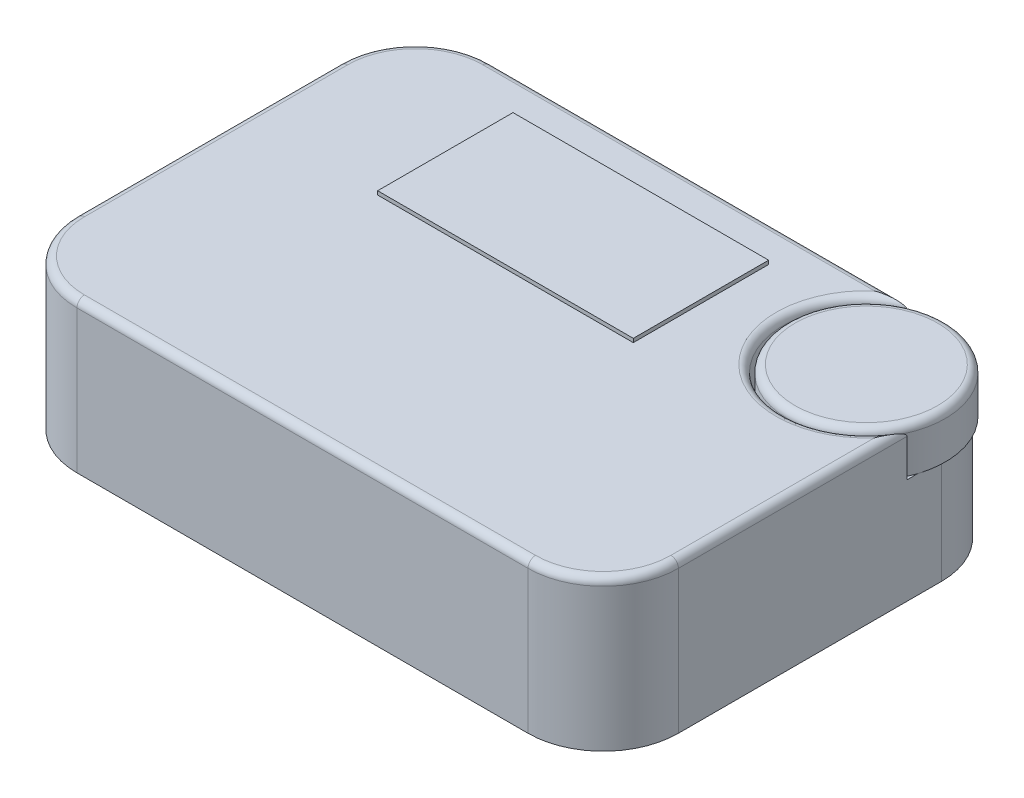
ISO-10303-21;
HEADER;
FILE_DESCRIPTION(('STEP AP214'),'2;1');
FILE_NAME('part.step','',(''),(''),'','','');
FILE_SCHEMA(('AUTOMOTIVE_DESIGN { 1 0 10303 214 1 1 1 1 }'));
ENDSEC;
DATA;
#1=APPLICATION_CONTEXT('core data for automotive mechanical design processes');
#2=APPLICATION_PROTOCOL_DEFINITION('international standard','automotive_design',2000,#1);
#3=PRODUCT_CONTEXT('',#1,'mechanical');
#4=PRODUCT('Part','Part','',(#3));
#5=PRODUCT_RELATED_PRODUCT_CATEGORY('part','',(#4));
#6=PRODUCT_DEFINITION_FORMATION('','',#4);
#7=PRODUCT_DEFINITION_CONTEXT('part definition',#1,'design');
#8=PRODUCT_DEFINITION('design','',#6,#7);
#9=PRODUCT_DEFINITION_SHAPE('','',#8);
#10=(LENGTH_UNIT() NAMED_UNIT(*) SI_UNIT(.MILLI.,.METRE.));
#11=(NAMED_UNIT(*) PLANE_ANGLE_UNIT() SI_UNIT($,.RADIAN.));
#12=(NAMED_UNIT(*) SI_UNIT($,.STERADIAN.) SOLID_ANGLE_UNIT());
#13=UNCERTAINTY_MEASURE_WITH_UNIT(LENGTH_MEASURE(1.E-05),#10,'distance_accuracy_value','');
#14=(GEOMETRIC_REPRESENTATION_CONTEXT(3) GLOBAL_UNCERTAINTY_ASSIGNED_CONTEXT((#13)) GLOBAL_UNIT_ASSIGNED_CONTEXT((#10,
#11,#12)) REPRESENTATION_CONTEXT('',''));
#15=CARTESIAN_POINT('',(0.,0.,0.));
#16=DIRECTION('',(0.,0.,1.));
#17=DIRECTION('',(1.,0.,0.));
#18=AXIS2_PLACEMENT_3D('',#15,#16,#17);
#19=CARTESIAN_POINT('',(30.,20.,-17.5));
#20=DIRECTION('',(0.,-1.,0.));
#21=DIRECTION('',(0.,0.,-1.));
#22=AXIS2_PLACEMENT_3D('',#19,#20,#21);
#23=CYLINDRICAL_SURFACE('',#22,10.);
#24=DIRECTION('',(0.,-1.,0.));
#25=VECTOR('',#24,1.);
#26=CARTESIAN_POINT('',(30.,20.,-27.5));
#27=LINE('',#26,#25);
#28=CARTESIAN_POINT('',(30.,14.,-27.5));
#29=VERTEX_POINT('',#28);
#30=CARTESIAN_POINT('',(30.,0.,-27.5));
#31=VERTEX_POINT('',#30);
#32=EDGE_CURVE('E262',#29,#31,#27,.T.);
#33=ORIENTED_EDGE('',*,*,#32,.F.);
#34=CARTESIAN_POINT('',(30.,14.,-17.5));
#35=DIRECTION('',(0.,1.,0.));
#36=DIRECTION('',(0.,0.,1.));
#37=AXIS2_PLACEMENT_3D('',#34,#35,#36);
#38=CIRCLE('',#37,10.);
#39=CARTESIAN_POINT('',(40.,14.,-17.5));
#40=VERTEX_POINT('',#39);
#41=EDGE_CURVE('E276',#29,#40,#38,.F.);
#42=ORIENTED_EDGE('',*,*,#41,.T.);
#43=DIRECTION('',(0.,-1.,0.));
#44=VECTOR('',#43,1.);
#45=CARTESIAN_POINT('',(40.,20.,-17.5));
#46=LINE('',#45,#44);
#47=CARTESIAN_POINT('',(40.,0.,-17.5));
#48=VERTEX_POINT('',#47);
#49=EDGE_CURVE('E269',#48,#40,#46,.F.);
#50=ORIENTED_EDGE('',*,*,#49,.F.);
#51=CARTESIAN_POINT('',(30.,0.,-17.5));
#52=DIRECTION('',(0.,1.,0.));
#53=DIRECTION('',(0.,0.,1.));
#54=AXIS2_PLACEMENT_3D('',#51,#52,#53);
#55=CIRCLE('',#54,10.);
#56=EDGE_CURVE('E258',#31,#48,#55,.F.);
#57=ORIENTED_EDGE('',*,*,#56,.F.);
#58=EDGE_LOOP('',(#33,#42,#50,#57));
#59=FACE_BOUND('',#58,.T.);
#60=ADVANCED_FACE('F45',(#59),#23,.T.);
#61=CARTESIAN_POINT('',(40.,20.,-27.5));
#62=DIRECTION('',(-1.,0.,0.));
#63=DIRECTION('',(0.,0.,1.));
#64=AXIS2_PLACEMENT_3D('',#61,#62,#63);
#65=PLANE('',#64);
#66=DIRECTION('',(0.,1.,0.));
#67=VECTOR('',#66,1.);
#68=CARTESIAN_POINT('',(40.,14.,-12.9174243050442));
#69=LINE('',#68,#67);
#70=CARTESIAN_POINT('',(40.,14.,-12.9174243050442));
#71=VERTEX_POINT('',#70);
#72=CARTESIAN_POINT('',(40.,19.,-12.9174243050442));
#73=VERTEX_POINT('',#72);
#74=EDGE_CURVE('E235',#71,#73,#69,.T.);
#75=ORIENTED_EDGE('',*,*,#74,.T.);
#76=DIRECTION('',(0.,0.,-1.));
#77=VECTOR('',#76,1.);
#78=CARTESIAN_POINT('',(40.,19.,17.5));
#79=LINE('',#78,#77);
#80=CARTESIAN_POINT('',(40.,19.,17.5));
#81=VERTEX_POINT('',#80);
#82=EDGE_CURVE('E68',#73,#81,#79,.F.);
#83=ORIENTED_EDGE('',*,*,#82,.T.);
#84=DIRECTION('',(0.,-1.,0.));
#85=VECTOR('',#84,1.);
#86=CARTESIAN_POINT('',(40.,20.,17.5));
#87=LINE('',#86,#85);
#88=CARTESIAN_POINT('',(40.,0.,17.5));
#89=VERTEX_POINT('',#88);
#90=EDGE_CURVE('E267',#81,#89,#87,.T.);
#91=ORIENTED_EDGE('',*,*,#90,.T.);
#92=DIRECTION('',(0.,0.,-1.));
#93=VECTOR('',#92,1.);
#94=CARTESIAN_POINT('',(40.,0.,-27.5));
#95=LINE('',#94,#93);
#96=EDGE_CURVE('E237',#89,#48,#95,.T.);
#97=ORIENTED_EDGE('',*,*,#96,.T.);
#98=ORIENTED_EDGE('',*,*,#49,.T.);
#99=DIRECTION('',(0.,0.,-1.));
#100=VECTOR('',#99,1.);
#101=CARTESIAN_POINT('',(40.,14.,-27.5));
#102=LINE('',#101,#100);
#103=CARTESIAN_POINT('',(40.,14.,-14.2984378812836));
#104=VERTEX_POINT('',#103);
#105=EDGE_CURVE('E229',#104,#40,#102,.T.);
#106=ORIENTED_EDGE('',*,*,#105,.F.);
#107=EDGE_CURVE('E230',#71,#104,#102,.T.);
#108=ORIENTED_EDGE('',*,*,#107,.F.);
#109=EDGE_LOOP('',(#75,#83,#91,#97,#98,#106,#108));
#110=FACE_BOUND('',#109,.T.);
#111=ADVANCED_FACE('F373',(#110),#65,.F.);
#112=CARTESIAN_POINT('',(-40.,20.,-27.5));
#113=DIRECTION('',(0.,0.,1.));
#114=DIRECTION('',(1.,0.,0.));
#115=AXIS2_PLACEMENT_3D('',#112,#113,#114);
#116=PLANE('',#115);
#117=DIRECTION('',(0.,-1.,0.));
#118=VECTOR('',#117,1.);
#119=CARTESIAN_POINT('',(-30.,20.,-27.5));
#120=LINE('',#119,#118);
#121=CARTESIAN_POINT('',(-30.,0.,-27.5));
#122=VERTEX_POINT('',#121);
#123=CARTESIAN_POINT('',(-30.,19.,-27.5));
#124=VERTEX_POINT('',#123);
#125=EDGE_CURVE('E264',#122,#124,#120,.F.);
#126=ORIENTED_EDGE('',*,*,#125,.T.);
#127=DIRECTION('',(-1.,0.,0.));
#128=VECTOR('',#127,1.);
#129=CARTESIAN_POINT('',(25.4174243050442,19.,-27.5));
#130=LINE('',#129,#128);
#131=CARTESIAN_POINT('',(25.4174243050442,19.,-27.5));
#132=VERTEX_POINT('',#131);
#133=EDGE_CURVE('E299',#124,#132,#130,.F.);
#134=ORIENTED_EDGE('',*,*,#133,.T.);
#135=DIRECTION('',(0.,1.,0.));
#136=VECTOR('',#135,1.);
#137=CARTESIAN_POINT('',(25.4174243050442,14.,-27.5));
#138=LINE('',#137,#136);
#139=CARTESIAN_POINT('',(25.4174243050442,14.,-27.5));
#140=VERTEX_POINT('',#139);
#141=EDGE_CURVE('E233',#132,#140,#138,.F.);
#142=ORIENTED_EDGE('',*,*,#141,.T.);
#143=DIRECTION('',(-1.,0.,0.));
#144=VECTOR('',#143,1.);
#145=CARTESIAN_POINT('',(-40.,14.,-27.5));
#146=LINE('',#145,#144);
#147=CARTESIAN_POINT('',(26.7984378812836,14.,-27.5));
#148=VERTEX_POINT('',#147);
#149=EDGE_CURVE('E225',#148,#140,#146,.T.);
#150=ORIENTED_EDGE('',*,*,#149,.F.);
#151=EDGE_CURVE('E226',#29,#148,#146,.T.);
#152=ORIENTED_EDGE('',*,*,#151,.F.);
#153=ORIENTED_EDGE('',*,*,#32,.T.);
#154=DIRECTION('',(-1.,0.,0.));
#155=VECTOR('',#154,1.);
#156=CARTESIAN_POINT('',(-40.,0.,-27.5));
#157=LINE('',#156,#155);
#158=EDGE_CURVE('E240',#31,#122,#157,.T.);
#159=ORIENTED_EDGE('',*,*,#158,.T.);
#160=EDGE_LOOP('',(#126,#134,#142,#150,#152,#153,#159));
#161=FACE_BOUND('',#160,.T.);
#162=ADVANCED_FACE('F379',(#161),#116,.F.);
#163=CARTESIAN_POINT('',(-40.,20.,-27.5));
#164=DIRECTION('',(1.,0.,0.));
#165=DIRECTION('',(0.,0.,-1.));
#166=AXIS2_PLACEMENT_3D('',#163,#164,#165);
#167=PLANE('',#166);
#168=DIRECTION('',(0.,-1.,0.));
#169=VECTOR('',#168,1.);
#170=CARTESIAN_POINT('',(-40.,20.,17.5));
#171=LINE('',#170,#169);
#172=CARTESIAN_POINT('',(-40.,0.,17.5));
#173=VERTEX_POINT('',#172);
#174=CARTESIAN_POINT('',(-40.,19.,17.5));
#175=VERTEX_POINT('',#174);
#176=EDGE_CURVE('E249',#173,#175,#171,.F.);
#177=ORIENTED_EDGE('',*,*,#176,.T.);
#178=DIRECTION('',(0.,0.,1.));
#179=VECTOR('',#178,1.);
#180=CARTESIAN_POINT('',(-40.,19.,-17.5));
#181=LINE('',#180,#179);
#182=CARTESIAN_POINT('',(-40.,19.,-17.5));
#183=VERTEX_POINT('',#182);
#184=EDGE_CURVE('E304',#175,#183,#181,.F.);
#185=ORIENTED_EDGE('',*,*,#184,.T.);
#186=DIRECTION('',(0.,-1.,0.));
#187=VECTOR('',#186,1.);
#188=CARTESIAN_POINT('',(-40.,20.,-17.5));
#189=LINE('',#188,#187);
#190=CARTESIAN_POINT('',(-40.,0.,-17.5));
#191=VERTEX_POINT('',#190);
#192=EDGE_CURVE('E252',#183,#191,#189,.T.);
#193=ORIENTED_EDGE('',*,*,#192,.T.);
#194=DIRECTION('',(0.,0.,1.));
#195=VECTOR('',#194,1.);
#196=CARTESIAN_POINT('',(-40.,0.,-27.5));
#197=LINE('',#196,#195);
#198=EDGE_CURVE('E243',#191,#173,#197,.T.);
#199=ORIENTED_EDGE('',*,*,#198,.T.);
#200=EDGE_LOOP('',(#177,#185,#193,#199));
#201=FACE_BOUND('',#200,.T.);
#202=ADVANCED_FACE('F420',(#201),#167,.F.);
#203=CARTESIAN_POINT('',(-40.,20.,27.5));
#204=DIRECTION('',(0.,0.,-1.));
#205=DIRECTION('',(-1.,0.,0.));
#206=AXIS2_PLACEMENT_3D('',#203,#204,#205);
#207=PLANE('',#206);
#208=DIRECTION('',(0.,-1.,0.));
#209=VECTOR('',#208,1.);
#210=CARTESIAN_POINT('',(30.,20.,27.5));
#211=LINE('',#210,#209);
#212=CARTESIAN_POINT('',(30.,0.,27.5));
#213=VERTEX_POINT('',#212);
#214=CARTESIAN_POINT('',(30.,19.,27.5));
#215=VERTEX_POINT('',#214);
#216=EDGE_CURVE('E274',#213,#215,#211,.F.);
#217=ORIENTED_EDGE('',*,*,#216,.T.);
#218=DIRECTION('',(1.,0.,0.));
#219=VECTOR('',#218,1.);
#220=CARTESIAN_POINT('',(-30.,19.,27.5));
#221=LINE('',#220,#219);
#222=CARTESIAN_POINT('',(-30.,19.,27.5));
#223=VERTEX_POINT('',#222);
#224=EDGE_CURVE('E312',#215,#223,#221,.F.);
#225=ORIENTED_EDGE('',*,*,#224,.T.);
#226=DIRECTION('',(0.,-1.,0.));
#227=VECTOR('',#226,1.);
#228=CARTESIAN_POINT('',(-30.,20.,27.5));
#229=LINE('',#228,#227);
#230=CARTESIAN_POINT('',(-30.,0.,27.5));
#231=VERTEX_POINT('',#230);
#232=EDGE_CURVE('E272',#223,#231,#229,.T.);
#233=ORIENTED_EDGE('',*,*,#232,.T.);
#234=DIRECTION('',(1.,0.,0.));
#235=VECTOR('',#234,1.);
#236=CARTESIAN_POINT('',(-40.,0.,27.5));
#237=LINE('',#236,#235);
#238=EDGE_CURVE('E246',#231,#213,#237,.T.);
#239=ORIENTED_EDGE('',*,*,#238,.T.);
#240=EDGE_LOOP('',(#217,#225,#233,#239));
#241=FACE_BOUND('',#240,.T.);
#242=ADVANCED_FACE('F430',(#241),#207,.F.);
#243=CARTESIAN_POINT('',(0.,20.,0.));
#244=DIRECTION('',(0.,1.,0.));
#245=DIRECTION('',(0.,0.,1.));
#246=AXIS2_PLACEMENT_3D('',#243,#244,#245);
#247=PLANE('',#246);
#248=DIRECTION('',(0.,0.,-1.));
#249=VECTOR('',#248,1.);
#250=CARTESIAN_POINT('',(39.,20.,-12.9174243050442));
#251=LINE('',#250,#249);
#252=CARTESIAN_POINT('',(39.,20.,17.5));
#253=VERTEX_POINT('',#252);
#254=CARTESIAN_POINT('',(39.,20.,-9.56274606680624));
#255=VERTEX_POINT('',#254);
#256=EDGE_CURVE('E286',#253,#255,#251,.T.);
#257=ORIENTED_EDGE('',*,*,#256,.T.);
#258=CARTESIAN_POINT('',(30.,20.,-17.5));
#259=DIRECTION('',(0.,1.,0.));
#260=DIRECTION('',(0.,0.,1.));
#261=AXIS2_PLACEMENT_3D('',#258,#259,#260);
#262=CIRCLE('',#261,12.);
#263=CARTESIAN_POINT('',(22.0627460668062,20.,-26.5));
#264=VERTEX_POINT('',#263);
#265=EDGE_CURVE('E297',#255,#264,#262,.F.);
#266=ORIENTED_EDGE('',*,*,#265,.T.);
#267=DIRECTION('',(-1.,0.,0.));
#268=VECTOR('',#267,1.);
#269=CARTESIAN_POINT('',(-30.,20.,-26.5));
#270=LINE('',#269,#268);
#271=CARTESIAN_POINT('',(-30.,20.,-26.5));
#272=VERTEX_POINT('',#271);
#273=EDGE_CURVE('E294',#264,#272,#270,.T.);
#274=ORIENTED_EDGE('',*,*,#273,.T.);
#275=CARTESIAN_POINT('',(-30.,20.,-17.5));
#276=DIRECTION('',(0.,1.,0.));
#277=DIRECTION('',(0.,0.,1.));
#278=AXIS2_PLACEMENT_3D('',#275,#276,#277);
#279=CIRCLE('',#278,9.);
#280=CARTESIAN_POINT('',(-39.,20.,-17.5));
#281=VERTEX_POINT('',#280);
#282=EDGE_CURVE('E292',#272,#281,#279,.T.);
#283=ORIENTED_EDGE('',*,*,#282,.T.);
#284=DIRECTION('',(0.,0.,1.));
#285=VECTOR('',#284,1.);
#286=CARTESIAN_POINT('',(-39.,20.,17.5));
#287=LINE('',#286,#285);
#288=CARTESIAN_POINT('',(-39.,20.,17.5));
#289=VERTEX_POINT('',#288);
#290=EDGE_CURVE('E290',#281,#289,#287,.T.);
#291=ORIENTED_EDGE('',*,*,#290,.T.);
#292=CARTESIAN_POINT('',(-30.,20.,17.5));
#293=DIRECTION('',(0.,1.,0.));
#294=DIRECTION('',(0.,0.,1.));
#295=AXIS2_PLACEMENT_3D('',#292,#293,#294);
#296=CIRCLE('',#295,9.);
#297=CARTESIAN_POINT('',(-30.,20.,26.5));
#298=VERTEX_POINT('',#297);
#299=EDGE_CURVE('E288',#289,#298,#296,.T.);
#300=ORIENTED_EDGE('',*,*,#299,.T.);
#301=DIRECTION('',(1.,0.,0.));
#302=VECTOR('',#301,1.);
#303=CARTESIAN_POINT('',(30.,20.,26.5));
#304=LINE('',#303,#302);
#305=CARTESIAN_POINT('',(30.,20.,26.5));
#306=VERTEX_POINT('',#305);
#307=EDGE_CURVE('E282',#298,#306,#304,.T.);
#308=ORIENTED_EDGE('',*,*,#307,.T.);
#309=CARTESIAN_POINT('',(30.,20.,17.5));
#310=DIRECTION('',(0.,1.,0.));
#311=DIRECTION('',(0.,0.,1.));
#312=AXIS2_PLACEMENT_3D('',#309,#310,#311);
#313=CIRCLE('',#312,9.);
#314=EDGE_CURVE('E284',#306,#253,#313,.T.);
#315=ORIENTED_EDGE('',*,*,#314,.T.);
#316=EDGE_LOOP('',(#257,#266,#274,#283,#291,#300,#308,#315));
#317=FACE_BOUND('',#316,.T.);
#318=DIRECTION('',(0.,0.,-1.));
#319=VECTOR('',#318,1.);
#320=CARTESIAN_POINT('',(12.,20.,-22.5));
#321=LINE('',#320,#319);
#322=CARTESIAN_POINT('',(12.,20.,-4.50000000000001));
#323=VERTEX_POINT('',#322);
#324=CARTESIAN_POINT('',(12.,20.,-22.5));
#325=VERTEX_POINT('',#324);
#326=EDGE_CURVE('E201',#323,#325,#321,.T.);
#327=ORIENTED_EDGE('',*,*,#326,.F.);
#328=DIRECTION('',(1.,0.,0.));
#329=VECTOR('',#328,1.);
#330=CARTESIAN_POINT('',(-22.,20.,-4.50000000000001));
#331=LINE('',#330,#329);
#332=CARTESIAN_POINT('',(-22.,20.,-4.50000000000001));
#333=VERTEX_POINT('',#332);
#334=EDGE_CURVE('E219',#333,#323,#331,.T.);
#335=ORIENTED_EDGE('',*,*,#334,.F.);
#336=DIRECTION('',(0.,0.,1.));
#337=VECTOR('',#336,1.);
#338=CARTESIAN_POINT('',(-22.,20.,-22.5));
#339=LINE('',#338,#337);
#340=CARTESIAN_POINT('',(-22.,20.,-22.5));
#341=VERTEX_POINT('',#340);
#342=EDGE_CURVE('E216',#341,#333,#339,.T.);
#343=ORIENTED_EDGE('',*,*,#342,.F.);
#344=DIRECTION('',(-1.,0.,0.));
#345=VECTOR('',#344,1.);
#346=CARTESIAN_POINT('',(-22.,20.,-22.5));
#347=LINE('',#346,#345);
#348=EDGE_CURVE('E214',#325,#341,#347,.T.);
#349=ORIENTED_EDGE('',*,*,#348,.F.);
#350=EDGE_LOOP('',(#327,#335,#343,#349));
#351=FACE_BOUND('',#350,.T.);
#352=ADVANCED_FACE('F454',(#317,#351),#247,.T.);
#353=CARTESIAN_POINT('',(0.,0.,0.));
#354=DIRECTION('',(0.,1.,0.));
#355=DIRECTION('',(0.,0.,1.));
#356=AXIS2_PLACEMENT_3D('',#353,#354,#355);
#357=PLANE('',#356);
#358=ORIENTED_EDGE('',*,*,#198,.F.);
#359=CARTESIAN_POINT('',(-30.,0.,-17.5));
#360=DIRECTION('',(0.,1.,0.));
#361=DIRECTION('',(0.,0.,1.));
#362=AXIS2_PLACEMENT_3D('',#359,#360,#361);
#363=CIRCLE('',#362,10.);
#364=EDGE_CURVE('E260',#191,#122,#363,.F.);
#365=ORIENTED_EDGE('',*,*,#364,.T.);
#366=ORIENTED_EDGE('',*,*,#158,.F.);
#367=ORIENTED_EDGE('',*,*,#56,.T.);
#368=ORIENTED_EDGE('',*,*,#96,.F.);
#369=CARTESIAN_POINT('',(30.,0.,17.5));
#370=DIRECTION('',(0.,1.,0.));
#371=DIRECTION('',(0.,0.,1.));
#372=AXIS2_PLACEMENT_3D('',#369,#370,#371);
#373=CIRCLE('',#372,10.);
#374=EDGE_CURVE('E256',#89,#213,#373,.F.);
#375=ORIENTED_EDGE('',*,*,#374,.T.);
#376=ORIENTED_EDGE('',*,*,#238,.F.);
#377=CARTESIAN_POINT('',(-30.,0.,17.5));
#378=DIRECTION('',(0.,1.,0.));
#379=DIRECTION('',(0.,0.,1.));
#380=AXIS2_PLACEMENT_3D('',#377,#378,#379);
#381=CIRCLE('',#380,10.);
#382=EDGE_CURVE('E254',#231,#173,#381,.F.);
#383=ORIENTED_EDGE('',*,*,#382,.T.);
#384=EDGE_LOOP('',(#358,#365,#366,#367,#368,#375,#376,#383));
#385=FACE_BOUND('',#384,.T.);
#386=ADVANCED_FACE('F427',(#385),#357,.F.);
#387=CARTESIAN_POINT('',(-30.,20.,-17.5));
#388=DIRECTION('',(0.,-1.,0.));
#389=DIRECTION('',(0.,0.,-1.));
#390=AXIS2_PLACEMENT_3D('',#387,#388,#389);
#391=CYLINDRICAL_SURFACE('',#390,10.);
#392=ORIENTED_EDGE('',*,*,#192,.F.);
#393=CARTESIAN_POINT('',(-30.,19.,-17.5));
#394=DIRECTION('',(0.,1.,0.));
#395=DIRECTION('',(0.,0.,1.));
#396=AXIS2_PLACEMENT_3D('',#393,#394,#395);
#397=CIRCLE('',#396,10.);
#398=EDGE_CURVE('E302',#183,#124,#397,.F.);
#399=ORIENTED_EDGE('',*,*,#398,.T.);
#400=ORIENTED_EDGE('',*,*,#125,.F.);
#401=ORIENTED_EDGE('',*,*,#364,.F.);
#402=EDGE_LOOP('',(#392,#399,#400,#401));
#403=FACE_BOUND('',#402,.T.);
#404=ADVANCED_FACE('F384',(#403),#391,.T.);
#405=CARTESIAN_POINT('',(30.,20.,17.5));
#406=DIRECTION('',(0.,-1.,0.));
#407=DIRECTION('',(0.,0.,-1.));
#408=AXIS2_PLACEMENT_3D('',#405,#406,#407);
#409=CYLINDRICAL_SURFACE('',#408,10.);
#410=ORIENTED_EDGE('',*,*,#90,.F.);
#411=CARTESIAN_POINT('',(30.,19.,17.5));
#412=DIRECTION('',(0.,1.,0.));
#413=DIRECTION('',(0.,0.,1.));
#414=AXIS2_PLACEMENT_3D('',#411,#412,#413);
#415=CIRCLE('',#414,10.);
#416=EDGE_CURVE('E60',#81,#215,#415,.F.);
#417=ORIENTED_EDGE('',*,*,#416,.T.);
#418=ORIENTED_EDGE('',*,*,#216,.F.);
#419=ORIENTED_EDGE('',*,*,#374,.F.);
#420=EDGE_LOOP('',(#410,#417,#418,#419));
#421=FACE_BOUND('',#420,.T.);
#422=ADVANCED_FACE('F385',(#421),#409,.T.);
#423=CARTESIAN_POINT('',(-30.,20.,17.5));
#424=DIRECTION('',(0.,-1.,0.));
#425=DIRECTION('',(0.,0.,-1.));
#426=AXIS2_PLACEMENT_3D('',#423,#424,#425);
#427=CYLINDRICAL_SURFACE('',#426,10.);
#428=ORIENTED_EDGE('',*,*,#232,.F.);
#429=CARTESIAN_POINT('',(-30.,19.,17.5));
#430=DIRECTION('',(0.,1.,0.));
#431=DIRECTION('',(0.,0.,1.));
#432=AXIS2_PLACEMENT_3D('',#429,#430,#431);
#433=CIRCLE('',#432,10.);
#434=EDGE_CURVE('E306',#223,#175,#433,.F.);
#435=ORIENTED_EDGE('',*,*,#434,.T.);
#436=ORIENTED_EDGE('',*,*,#176,.F.);
#437=ORIENTED_EDGE('',*,*,#382,.F.);
#438=EDGE_LOOP('',(#428,#435,#436,#437));
#439=FACE_BOUND('',#438,.T.);
#440=ADVANCED_FACE('F387',(#439),#427,.T.);
#441=CARTESIAN_POINT('',(30.,14.,-17.5));
#442=DIRECTION('',(0.,1.,0.));
#443=DIRECTION('',(0.,0.,1.));
#444=AXIS2_PLACEMENT_3D('',#441,#442,#443);
#445=CYLINDRICAL_SURFACE('',#444,11.);
#446=ORIENTED_EDGE('',*,*,#141,.F.);
#447=CARTESIAN_POINT('',(30.,19.,-17.5));
#448=DIRECTION('',(0.,1.,0.));
#449=DIRECTION('',(0.,0.,1.));
#450=AXIS2_PLACEMENT_3D('',#447,#448,#449);
#451=CIRCLE('',#450,11.);
#452=EDGE_CURVE('E310',#132,#73,#451,.T.);
#453=ORIENTED_EDGE('',*,*,#452,.T.);
#454=ORIENTED_EDGE('',*,*,#74,.F.);
#455=CARTESIAN_POINT('',(30.,14.,-17.5));
#456=DIRECTION('',(0.,1.,0.));
#457=DIRECTION('',(0.,0.,1.));
#458=AXIS2_PLACEMENT_3D('',#455,#456,#457);
#459=CIRCLE('',#458,11.);
#460=EDGE_CURVE('E222',#140,#71,#459,.T.);
#461=ORIENTED_EDGE('',*,*,#460,.F.);
#462=EDGE_LOOP('',(#446,#453,#454,#461));
#463=FACE_BOUND('',#462,.T.);
#464=ADVANCED_FACE('F389',(#463),#445,.F.);
#465=CARTESIAN_POINT('',(30.,14.,-17.5));
#466=DIRECTION('',(0.,1.,0.));
#467=DIRECTION('',(0.,0.,1.));
#468=AXIS2_PLACEMENT_3D('',#465,#466,#467);
#469=PLANE('',#468);
#470=ORIENTED_EDGE('',*,*,#107,.T.);
#471=CARTESIAN_POINT('',(30.,14.,-17.5));
#472=DIRECTION('',(0.,1.,0.));
#473=DIRECTION('',(0.,0.,1.));
#474=AXIS2_PLACEMENT_3D('',#471,#472,#473);
#475=CIRCLE('',#474,10.5);
#476=EDGE_CURVE('E279',#104,#148,#475,.F.);
#477=ORIENTED_EDGE('',*,*,#476,.T.);
#478=ORIENTED_EDGE('',*,*,#149,.T.);
#479=ORIENTED_EDGE('',*,*,#460,.T.);
#480=EDGE_LOOP('',(#470,#477,#478,#479));
#481=FACE_BOUND('',#480,.T.);
#482=ADVANCED_FACE('F394',(#481),#469,.T.);
#483=CARTESIAN_POINT('',(30.,14.,-17.5));
#484=DIRECTION('',(0.,1.,0.));
#485=DIRECTION('',(0.,0.,1.));
#486=AXIS2_PLACEMENT_3D('',#483,#484,#485);
#487=PLANE('',#486);
#488=CARTESIAN_POINT('',(30.,14.,-17.5));
#489=DIRECTION('',(0.,1.,0.));
#490=DIRECTION('',(0.,0.,1.));
#491=AXIS2_PLACEMENT_3D('',#488,#489,#490);
#492=CIRCLE('',#491,10.5);
#493=EDGE_CURVE('E210',#104,#148,#492,.T.);
#494=ORIENTED_EDGE('',*,*,#493,.F.);
#495=ORIENTED_EDGE('',*,*,#105,.T.);
#496=ORIENTED_EDGE('',*,*,#41,.F.);
#497=ORIENTED_EDGE('',*,*,#151,.T.);
#498=EDGE_LOOP('',(#494,#495,#496,#497));
#499=FACE_BOUND('',#498,.T.);
#500=ADVANCED_FACE('F437',(#499),#487,.F.);
#501=CARTESIAN_POINT('',(30.,49.698484809835,-17.5));
#502=DIRECTION('',(0.,-1.,0.));
#503=DIRECTION('',(0.,0.,-1.));
#504=AXIS2_PLACEMENT_3D('',#501,#502,#503);
#505=CYLINDRICAL_SURFACE('',#504,10.5);
#506=CARTESIAN_POINT('',(30.,19.,-17.5));
#507=DIRECTION('',(0.,1.,0.));
#508=DIRECTION('',(0.,0.,1.));
#509=AXIS2_PLACEMENT_3D('',#506,#507,#508);
#510=CIRCLE('',#509,10.5);
#511=CARTESIAN_POINT('',(30.,19.,-7.00000000000001));
#512=VERTEX_POINT('',#511);
#513=EDGE_CURVE('E11',#512,#512,#510,.F.);
#514=ORIENTED_EDGE('',*,*,#513,.T.);
#515=EDGE_LOOP('',(#514));
#516=FACE_BOUND('',#515,.T.);
#517=ORIENTED_EDGE('',*,*,#493,.T.);
#518=ORIENTED_EDGE('',*,*,#476,.F.);
#519=EDGE_LOOP('',(#517,#518));
#520=FACE_BOUND('',#519,.T.);
#521=ADVANCED_FACE('F468',(#516,#520),#505,.T.);
#522=CARTESIAN_POINT('',(0.,20.,0.));
#523=DIRECTION('',(0.,1.,0.));
#524=DIRECTION('',(0.,0.,1.));
#525=AXIS2_PLACEMENT_3D('',#522,#523,#524);
#526=PLANE('',#525);
#527=CARTESIAN_POINT('',(30.,20.,-17.5));
#528=DIRECTION('',(0.,1.,0.));
#529=DIRECTION('',(0.,0.,1.));
#530=AXIS2_PLACEMENT_3D('',#527,#528,#529);
#531=CIRCLE('',#530,9.5);
#532=CARTESIAN_POINT('',(30.,20.,-8.00000000000001));
#533=VERTEX_POINT('',#532);
#534=EDGE_CURVE('E53',#533,#533,#531,.T.);
#535=ORIENTED_EDGE('',*,*,#534,.T.);
#536=EDGE_LOOP('',(#535));
#537=FACE_BOUND('',#536,.T.);
#538=ADVANCED_FACE('F363',(#537),#526,.T.);
#539=CARTESIAN_POINT('',(0.,19.,26.5));
#540=DIRECTION('',(-1.,0.,0.));
#541=DIRECTION('',(0.,0.,1.));
#542=AXIS2_PLACEMENT_3D('',#539,#540,#541);
#543=CYLINDRICAL_SURFACE('',#542,1.);
#544=CARTESIAN_POINT('',(-30.,19.,26.5));
#545=DIRECTION('',(-1.,0.,0.));
#546=DIRECTION('',(0.,0.,1.));
#547=AXIS2_PLACEMENT_3D('',#544,#545,#546);
#548=CIRCLE('',#547,1.);
#549=EDGE_CURVE('E356',#223,#298,#548,.T.);
#550=ORIENTED_EDGE('',*,*,#549,.F.);
#551=ORIENTED_EDGE('',*,*,#224,.F.);
#552=CARTESIAN_POINT('',(30.,19.,26.5));
#553=DIRECTION('',(1.,0.,0.));
#554=DIRECTION('',(0.,0.,-1.));
#555=AXIS2_PLACEMENT_3D('',#552,#553,#554);
#556=CIRCLE('',#555,1.);
#557=EDGE_CURVE('E212',#306,#215,#556,.T.);
#558=ORIENTED_EDGE('',*,*,#557,.F.);
#559=ORIENTED_EDGE('',*,*,#307,.F.);
#560=EDGE_LOOP('',(#550,#551,#558,#559));
#561=FACE_BOUND('',#560,.T.);
#562=ADVANCED_FACE('F407',(#561),#543,.T.);
#563=CARTESIAN_POINT('',(30.,19.,17.5));
#564=DIRECTION('',(0.,1.,0.));
#565=DIRECTION('',(0.,0.,1.));
#566=AXIS2_PLACEMENT_3D('',#563,#564,#565);
#567=TOROIDAL_SURFACE('',#566,9.,1.);
#568=ORIENTED_EDGE('',*,*,#557,.T.);
#569=ORIENTED_EDGE('',*,*,#416,.F.);
#570=CARTESIAN_POINT('',(39.,19.,17.5));
#571=DIRECTION('',(0.,0.,-1.));
#572=DIRECTION('',(-1.,0.,0.));
#573=AXIS2_PLACEMENT_3D('',#570,#571,#572);
#574=CIRCLE('',#573,1.);
#575=EDGE_CURVE('E353',#253,#81,#574,.T.);
#576=ORIENTED_EDGE('',*,*,#575,.F.);
#577=ORIENTED_EDGE('',*,*,#314,.F.);
#578=EDGE_LOOP('',(#568,#569,#576,#577));
#579=FACE_BOUND('',#578,.T.);
#580=ADVANCED_FACE('F458',(#579),#567,.T.);
#581=CARTESIAN_POINT('',(-30.,19.,17.5));
#582=DIRECTION('',(0.,1.,0.));
#583=DIRECTION('',(0.,0.,1.));
#584=AXIS2_PLACEMENT_3D('',#581,#582,#583);
#585=TOROIDAL_SURFACE('',#584,9.,1.);
#586=ORIENTED_EDGE('',*,*,#549,.T.);
#587=ORIENTED_EDGE('',*,*,#299,.F.);
#588=CARTESIAN_POINT('',(-39.,19.,17.5));
#589=DIRECTION('',(0.,0.,-1.));
#590=DIRECTION('',(-1.,0.,0.));
#591=AXIS2_PLACEMENT_3D('',#588,#589,#590);
#592=CIRCLE('',#591,1.);
#593=EDGE_CURVE('E350',#175,#289,#592,.T.);
#594=ORIENTED_EDGE('',*,*,#593,.F.);
#595=ORIENTED_EDGE('',*,*,#434,.F.);
#596=EDGE_LOOP('',(#586,#587,#594,#595));
#597=FACE_BOUND('',#596,.T.);
#598=ADVANCED_FACE('F340',(#597),#585,.T.);
#599=CARTESIAN_POINT('',(39.,19.,0.));
#600=DIRECTION('',(0.,0.,1.));
#601=DIRECTION('',(1.,0.,0.));
#602=AXIS2_PLACEMENT_3D('',#599,#600,#601);
#603=CYLINDRICAL_SURFACE('',#602,1.);
#604=ORIENTED_EDGE('',*,*,#575,.T.);
#605=ORIENTED_EDGE('',*,*,#82,.F.);
#606=CARTESIAN_POINT('',(40.,19.,-12.9174243050442));
#607=CARTESIAN_POINT('',(40.0000081276133,19.0132038904421,-12.9174629912172));
#608=CARTESIAN_POINT('',(39.9997388550734,19.026352857777,-12.9162275091528));
#609=CARTESIAN_POINT('',(39.9987232271353,19.0520656147265,-12.9115761875846));
#610=CARTESIAN_POINT('',(39.9979833346562,19.0646348950776,-12.9081898857009));
#611=CARTESIAN_POINT('',(39.9957970109023,19.0930254972853,-12.8982008224105));
#612=CARTESIAN_POINT('',(39.9941996906918,19.1085886655605,-12.8909130231236));
#613=CARTESIAN_POINT('',(39.9904888740453,19.1384160192777,-12.8740363222017));
#614=CARTESIAN_POINT('',(39.9883722310753,19.1526715298017,-12.8644333998369));
#615=CARTESIAN_POINT('',(39.9818663718026,19.1912714086847,-12.8350275835124));
#616=CARTESIAN_POINT('',(39.9770531145137,19.2141248145269,-12.8133928505069));
#617=CARTESIAN_POINT('',(39.9667451203419,19.2566706870756,-12.767427337999));
#618=CARTESIAN_POINT('',(39.961248768302,19.276355399471,-12.7430901837394));
#619=CARTESIAN_POINT('',(39.9459326535171,19.3260055919423,-12.6758326859382));
#620=CARTESIAN_POINT('',(39.9357067593534,19.3539002596622,-12.6314936876511));
#621=CARTESIAN_POINT('',(39.914453920664,19.4056426297112,-12.5406630600406));
#622=CARTESIAN_POINT('',(39.903425007913,19.4294798754074,-12.4941662502994));
#623=CARTESIAN_POINT('',(39.8806872944902,19.4743692876451,-12.3996689654825));
#624=CARTESIAN_POINT('',(39.8689749080105,19.4954044240724,-12.3516613097827));
#625=CARTESIAN_POINT('',(39.8450372869235,19.5352081139753,-12.2549284886788));
#626=CARTESIAN_POINT('',(39.8328126941863,19.5539793963104,-12.2062042681839));
#627=CARTESIAN_POINT('',(39.7970113151646,19.6053497835132,-12.0654874538931));
#628=CARTESIAN_POINT('',(39.7728359070146,19.6357236811214,-11.9728353212572));
#629=CARTESIAN_POINT('',(39.722976716275,19.6918849155901,-11.7865357078878));
#630=CARTESIAN_POINT('',(39.6972922092378,19.7176700252605,-11.6928877670749));
#631=CARTESIAN_POINT('',(39.6444525994525,19.7654755757755,-11.5048482088886));
#632=CARTESIAN_POINT('',(39.6172948087428,19.7874888084923,-11.4104555204058));
#633=CARTESIAN_POINT('',(39.5616047404931,19.8281212480788,-11.2213417855487));
#634=CARTESIAN_POINT('',(39.5330722987595,19.8467400482279,-11.1266207012097));
#635=CARTESIAN_POINT('',(39.4456452902624,19.8977534375531,-10.8427776996566));
#636=CARTESIAN_POINT('',(39.3847609940444,19.9254458715083,-10.6534061437161));
#637=CARTESIAN_POINT('',(39.2580384331412,19.9684413813096,-10.2751743056093));
#638=CARTESIAN_POINT('',(39.1922068405099,19.9837608272201,-10.0863136784684));
#639=CARTESIAN_POINT('',(39.1042154854554,19.9947539839369,-9.84324110102483));
#640=CARTESIAN_POINT('',(39.0841862651288,19.9966556605087,-9.78850411986314));
#641=CARTESIAN_POINT('',(39.0437491753848,19.9992482757728,-9.67916112129743));
#642=CARTESIAN_POINT('',(39.0233414494866,19.9999396642583,-9.62455506277485));
#643=CARTESIAN_POINT('',(39.0018325755321,19.9999987384569,-9.56759571660208));
#644=CARTESIAN_POINT('',(39.0009164707511,19.9999999982144,-9.56517082003938));
#645=CARTESIAN_POINT('',(39.,20.,-9.56274606680624));
#646=B_SPLINE_CURVE_WITH_KNOTS('',3,(#606,#607,#608,#609,#610,#611,#612,#613,#614,#615,#616,
#617,#618,#619,#620,#621,#622,#623,#624,#625,#626,#627,#628,#629,#630,#631,#632,#633,#634,#635,
#636,#637,#638,#639,#640,#641,#642,#643,#644,#645),.UNSPECIFIED.,.F.,.F.,(4,2,2,2,2,2,2,2,2,2,2,
2,2,2,2,2,2,2,2,4),(0.,0.0394627724241728,0.0783949789464095,0.129880041074227,
0.181685103332218,0.27665606304109,0.371856010560101,0.531557560535988,0.691664652392949,
0.852704274775701,1.01354779686674,1.3147292160004,1.61605641864456,1.91795319185603,
2.21988611457443,2.82193054858594,3.42317713771404,3.59812078650048,3.77299940516804,
3.7807759295417),.UNSPECIFIED.);
#647=EDGE_CURVE('E343',#255,#73,#646,.F.);
#648=ORIENTED_EDGE('',*,*,#647,.F.);
#649=ORIENTED_EDGE('',*,*,#256,.F.);
#650=EDGE_LOOP('',(#604,#605,#648,#649));
#651=FACE_BOUND('',#650,.T.);
#652=ADVANCED_FACE('F335',(#651),#603,.T.);
#653=CARTESIAN_POINT('',(-39.,19.,0.));
#654=DIRECTION('',(0.,0.,-1.));
#655=DIRECTION('',(-1.,0.,0.));
#656=AXIS2_PLACEMENT_3D('',#653,#654,#655);
#657=CYLINDRICAL_SURFACE('',#656,1.);
#658=ORIENTED_EDGE('',*,*,#593,.T.);
#659=ORIENTED_EDGE('',*,*,#290,.F.);
#660=CARTESIAN_POINT('',(-39.,19.,-17.5));
#661=DIRECTION('',(0.,0.,-1.));
#662=DIRECTION('',(-1.,0.,0.));
#663=AXIS2_PLACEMENT_3D('',#660,#661,#662);
#664=CIRCLE('',#663,1.);
#665=EDGE_CURVE('E321',#183,#281,#664,.T.);
#666=ORIENTED_EDGE('',*,*,#665,.F.);
#667=ORIENTED_EDGE('',*,*,#184,.F.);
#668=EDGE_LOOP('',(#658,#659,#666,#667));
#669=FACE_BOUND('',#668,.T.);
#670=ADVANCED_FACE('F339',(#669),#657,.T.);
#671=CARTESIAN_POINT('',(30.,19.,-17.5));
#672=DIRECTION('',(0.,1.,0.));
#673=DIRECTION('',(0.,0.,1.));
#674=AXIS2_PLACEMENT_3D('',#671,#672,#673);
#675=TOROIDAL_SURFACE('',#674,12.,1.);
#676=ORIENTED_EDGE('',*,*,#647,.T.);
#677=ORIENTED_EDGE('',*,*,#452,.F.);
#678=CARTESIAN_POINT('',(25.4174243050442,19.,-27.5));
#679=CARTESIAN_POINT('',(25.4174629912172,19.0132038904421,-27.5000081276133));
#680=CARTESIAN_POINT('',(25.4162275091528,19.026352857777,-27.4997388550734));
#681=CARTESIAN_POINT('',(25.4115761875846,19.0520656147265,-27.4987232271353));
#682=CARTESIAN_POINT('',(25.408189885701,19.0646348950776,-27.4979833346562));
#683=CARTESIAN_POINT('',(25.3982008224105,19.0930254972853,-27.4957970109023));
#684=CARTESIAN_POINT('',(25.3909130231236,19.1085886655605,-27.4941996906918));
#685=CARTESIAN_POINT('',(25.3740363222017,19.1384160192777,-27.4904888740453));
#686=CARTESIAN_POINT('',(25.3644333998369,19.1526715298017,-27.4883722310753));
#687=CARTESIAN_POINT('',(25.3350275835124,19.1912714086847,-27.4818663718026));
#688=CARTESIAN_POINT('',(25.3133928505069,19.2141248145269,-27.4770531145137));
#689=CARTESIAN_POINT('',(25.267427337999,19.2566706870756,-27.4667451203419));
#690=CARTESIAN_POINT('',(25.2430901837394,19.276355399471,-27.461248768302));
#691=CARTESIAN_POINT('',(25.1758326859382,19.3260055919423,-27.4459326535171));
#692=CARTESIAN_POINT('',(25.1314936876511,19.3539002596622,-27.4357067593534));
#693=CARTESIAN_POINT('',(25.0406630600406,19.4056426297112,-27.414453920664));
#694=CARTESIAN_POINT('',(24.9941662502994,19.4294798754074,-27.403425007913));
#695=CARTESIAN_POINT('',(24.8996689654826,19.4743692876451,-27.3806872944902));
#696=CARTESIAN_POINT('',(24.8516613097827,19.4954044240724,-27.3689749080105));
#697=CARTESIAN_POINT('',(24.7549284886789,19.5352081139752,-27.3450372869235));
#698=CARTESIAN_POINT('',(24.706204268184,19.5539793963104,-27.3328126941863));
#699=CARTESIAN_POINT('',(24.5654874538931,19.6053497835132,-27.2970113151646));
#700=CARTESIAN_POINT('',(24.4728353212572,19.6357236811214,-27.2728359070146));
#701=CARTESIAN_POINT('',(24.2865357078878,19.69188491559,-27.222976716275));
#702=CARTESIAN_POINT('',(24.1928877670749,19.7176700252605,-27.1972922092378));
#703=CARTESIAN_POINT('',(24.0048482088886,19.7654755757755,-27.1444525994525));
#704=CARTESIAN_POINT('',(23.9104555204059,19.7874888084923,-27.1172948087428));
#705=CARTESIAN_POINT('',(23.7213417855487,19.8281212480788,-27.0616047404931));
#706=CARTESIAN_POINT('',(23.6266207012097,19.8467400482279,-27.0330722987596));
#707=CARTESIAN_POINT('',(23.3427776996566,19.8977534375531,-26.9456452902624));
#708=CARTESIAN_POINT('',(23.1534061437162,19.9254458715083,-26.8847609940444));
#709=CARTESIAN_POINT('',(22.7751743056093,19.9684413813096,-26.7580384331413));
#710=CARTESIAN_POINT('',(22.5863136784685,19.9837608272201,-26.6922068405099));
#711=CARTESIAN_POINT('',(22.3432411010249,19.9947539839369,-26.6042154854554));
#712=CARTESIAN_POINT('',(22.2885041198632,19.9966556605087,-26.5841862651288));
#713=CARTESIAN_POINT('',(22.1791611212975,19.9992482757728,-26.5437491753848));
#714=CARTESIAN_POINT('',(22.1245550627749,19.9999396642583,-26.5233414494866));
#715=CARTESIAN_POINT('',(22.0675957166021,19.9999987384569,-26.5018325755321));
#716=CARTESIAN_POINT('',(22.0651708200394,19.9999999982144,-26.5009164707511));
#717=CARTESIAN_POINT('',(22.0627460668062,20.,-26.5));
#718=B_SPLINE_CURVE_WITH_KNOTS('',3,(#678,#679,#680,#681,#682,#683,#684,#685,#686,#687,#688,
#689,#690,#691,#692,#693,#694,#695,#696,#697,#698,#699,#700,#701,#702,#703,#704,#705,#706,#707,
#708,#709,#710,#711,#712,#713,#714,#715,#716,#717),.UNSPECIFIED.,.F.,.F.,(4,2,2,2,2,2,2,2,2,2,2,
2,2,2,2,2,2,2,2,4),(0.,0.0394627724241725,0.0783949789464104,0.129880041074223,
0.181685103332215,0.27665606304108,0.371856010560094,0.531557560535972,0.691664652392936,
0.852704274775683,1.01354779686672,1.31472921600038,1.61605641864454,1.91795319185601,
2.21988611457441,2.8219305485859,3.42317713771399,3.59812078650044,3.77299940516804,
3.7807759295417),.UNSPECIFIED.);
#719=EDGE_CURVE('E204',#264,#132,#718,.F.);
#720=ORIENTED_EDGE('',*,*,#719,.F.);
#721=ORIENTED_EDGE('',*,*,#265,.F.);
#722=EDGE_LOOP('',(#676,#677,#720,#721));
#723=FACE_BOUND('',#722,.T.);
#724=ADVANCED_FACE('F323',(#723),#675,.T.);
#725=CARTESIAN_POINT('',(-30.,19.,-17.5));
#726=DIRECTION('',(0.,1.,0.));
#727=DIRECTION('',(0.,0.,1.));
#728=AXIS2_PLACEMENT_3D('',#725,#726,#727);
#729=TOROIDAL_SURFACE('',#728,9.,1.);
#730=ORIENTED_EDGE('',*,*,#665,.T.);
#731=ORIENTED_EDGE('',*,*,#282,.F.);
#732=CARTESIAN_POINT('',(-30.,19.,-26.5));
#733=DIRECTION('',(1.,0.,0.));
#734=DIRECTION('',(0.,0.,-1.));
#735=AXIS2_PLACEMENT_3D('',#732,#733,#734);
#736=CIRCLE('',#735,1.);
#737=EDGE_CURVE('E202',#124,#272,#736,.T.);
#738=ORIENTED_EDGE('',*,*,#737,.F.);
#739=ORIENTED_EDGE('',*,*,#398,.F.);
#740=EDGE_LOOP('',(#730,#731,#738,#739));
#741=FACE_BOUND('',#740,.T.);
#742=ADVANCED_FACE('F330',(#741),#729,.T.);
#743=CARTESIAN_POINT('',(0.,19.,-26.5));
#744=DIRECTION('',(1.,0.,0.));
#745=DIRECTION('',(0.,0.,-1.));
#746=AXIS2_PLACEMENT_3D('',#743,#744,#745);
#747=CYLINDRICAL_SURFACE('',#746,1.);
#748=ORIENTED_EDGE('',*,*,#719,.T.);
#749=ORIENTED_EDGE('',*,*,#133,.F.);
#750=ORIENTED_EDGE('',*,*,#737,.T.);
#751=ORIENTED_EDGE('',*,*,#273,.F.);
#752=EDGE_LOOP('',(#748,#749,#750,#751));
#753=FACE_BOUND('',#752,.T.);
#754=ADVANCED_FACE('F326',(#753),#747,.T.);
#755=CARTESIAN_POINT('',(30.,19.,-17.5));
#756=DIRECTION('',(0.,1.,0.));
#757=DIRECTION('',(0.,0.,1.));
#758=AXIS2_PLACEMENT_3D('',#755,#756,#757);
#759=TOROIDAL_SURFACE('',#758,9.5,1.);
#760=ORIENTED_EDGE('',*,*,#513,.F.);
#761=EDGE_LOOP('',(#760));
#762=FACE_BOUND('',#761,.T.);
#763=ORIENTED_EDGE('',*,*,#534,.F.);
#764=EDGE_LOOP('',(#763));
#765=FACE_BOUND('',#764,.T.);
#766=ADVANCED_FACE('F47',(#762,#765),#759,.T.);
#767=CARTESIAN_POINT('',(12.,20.5,-22.5));
#768=DIRECTION('',(-1.,0.,0.));
#769=DIRECTION('',(0.,0.,1.));
#770=AXIS2_PLACEMENT_3D('',#767,#768,#769);
#771=PLANE('',#770);
#772=ORIENTED_EDGE('',*,*,#326,.T.);
#773=DIRECTION('',(0.,-1.,0.));
#774=VECTOR('',#773,1.);
#775=CARTESIAN_POINT('',(12.,20.5,-22.5));
#776=LINE('',#775,#774);
#777=CARTESIAN_POINT('',(12.,20.5,-22.5));
#778=VERTEX_POINT('',#777);
#779=EDGE_CURVE('E183',#778,#325,#776,.T.);
#780=ORIENTED_EDGE('',*,*,#779,.F.);
#781=DIRECTION('',(0.,0.,-1.));
#782=VECTOR('',#781,1.);
#783=CARTESIAN_POINT('',(12.,20.5,-22.5));
#784=LINE('',#783,#782);
#785=CARTESIAN_POINT('',(12.,20.5,-4.50000000000001));
#786=VERTEX_POINT('',#785);
#787=EDGE_CURVE('E189',#786,#778,#784,.T.);
#788=ORIENTED_EDGE('',*,*,#787,.F.);
#789=DIRECTION('',(0.,-1.,0.));
#790=VECTOR('',#789,1.);
#791=CARTESIAN_POINT('',(12.,20.5,-4.50000000000001));
#792=LINE('',#791,#790);
#793=EDGE_CURVE('E783',#786,#323,#792,.T.);
#794=ORIENTED_EDGE('',*,*,#793,.T.);
#795=EDGE_LOOP('',(#772,#780,#788,#794));
#796=FACE_BOUND('',#795,.T.);
#797=ADVANCED_FACE('F200',(#796),#771,.F.);
#798=CARTESIAN_POINT('',(-22.,20.5,-22.5));
#799=DIRECTION('',(0.,0.,1.));
#800=DIRECTION('',(1.,0.,0.));
#801=AXIS2_PLACEMENT_3D('',#798,#799,#800);
#802=PLANE('',#801);
#803=ORIENTED_EDGE('',*,*,#348,.T.);
#804=DIRECTION('',(0.,-1.,0.));
#805=VECTOR('',#804,1.);
#806=CARTESIAN_POINT('',(-22.,20.5,-22.5));
#807=LINE('',#806,#805);
#808=CARTESIAN_POINT('',(-22.,20.5,-22.5));
#809=VERTEX_POINT('',#808);
#810=EDGE_CURVE('E185',#809,#341,#807,.T.);
#811=ORIENTED_EDGE('',*,*,#810,.F.);
#812=DIRECTION('',(-1.,0.,0.));
#813=VECTOR('',#812,1.);
#814=CARTESIAN_POINT('',(-22.,20.5,-22.5));
#815=LINE('',#814,#813);
#816=EDGE_CURVE('E178',#778,#809,#815,.T.);
#817=ORIENTED_EDGE('',*,*,#816,.F.);
#818=ORIENTED_EDGE('',*,*,#779,.T.);
#819=EDGE_LOOP('',(#803,#811,#817,#818));
#820=FACE_BOUND('',#819,.T.);
#821=ADVANCED_FACE('F181',(#820),#802,.F.);
#822=CARTESIAN_POINT('',(-22.,20.5,-22.5));
#823=DIRECTION('',(1.,0.,0.));
#824=DIRECTION('',(0.,0.,-1.));
#825=AXIS2_PLACEMENT_3D('',#822,#823,#824);
#826=PLANE('',#825);
#827=ORIENTED_EDGE('',*,*,#342,.T.);
#828=DIRECTION('',(0.,-1.,0.));
#829=VECTOR('',#828,1.);
#830=CARTESIAN_POINT('',(-22.,20.5,-4.50000000000001));
#831=LINE('',#830,#829);
#832=CARTESIAN_POINT('',(-22.,20.5,-4.50000000000001));
#833=VERTEX_POINT('',#832);
#834=EDGE_CURVE('E206',#833,#333,#831,.T.);
#835=ORIENTED_EDGE('',*,*,#834,.F.);
#836=DIRECTION('',(0.,0.,1.));
#837=VECTOR('',#836,1.);
#838=CARTESIAN_POINT('',(-22.,20.5,-22.5));
#839=LINE('',#838,#837);
#840=EDGE_CURVE('E188',#809,#833,#839,.T.);
#841=ORIENTED_EDGE('',*,*,#840,.F.);
#842=ORIENTED_EDGE('',*,*,#810,.T.);
#843=EDGE_LOOP('',(#827,#835,#841,#842));
#844=FACE_BOUND('',#843,.T.);
#845=ADVANCED_FACE('F619',(#844),#826,.F.);
#846=CARTESIAN_POINT('',(-22.,20.5,-4.50000000000001));
#847=DIRECTION('',(0.,0.,-1.));
#848=DIRECTION('',(-1.,0.,0.));
#849=AXIS2_PLACEMENT_3D('',#846,#847,#848);
#850=PLANE('',#849);
#851=ORIENTED_EDGE('',*,*,#334,.T.);
#852=ORIENTED_EDGE('',*,*,#793,.F.);
#853=DIRECTION('',(1.,0.,0.));
#854=VECTOR('',#853,1.);
#855=CARTESIAN_POINT('',(-22.,20.5,-4.50000000000001));
#856=LINE('',#855,#854);
#857=EDGE_CURVE('E194',#833,#786,#856,.T.);
#858=ORIENTED_EDGE('',*,*,#857,.F.);
#859=ORIENTED_EDGE('',*,*,#834,.T.);
#860=EDGE_LOOP('',(#851,#852,#858,#859));
#861=FACE_BOUND('',#860,.T.);
#862=ADVANCED_FACE('F628',(#861),#850,.F.);
#863=CARTESIAN_POINT('',(0.,20.5,0.));
#864=DIRECTION('',(0.,1.,0.));
#865=DIRECTION('',(0.,0.,1.));
#866=AXIS2_PLACEMENT_3D('',#863,#864,#865);
#867=PLANE('',#866);
#868=ORIENTED_EDGE('',*,*,#787,.T.);
#869=ORIENTED_EDGE('',*,*,#816,.T.);
#870=ORIENTED_EDGE('',*,*,#840,.T.);
#871=ORIENTED_EDGE('',*,*,#857,.T.);
#872=EDGE_LOOP('',(#868,#869,#870,#871));
#873=FACE_BOUND('',#872,.T.);
#874=ADVANCED_FACE('F192',(#873),#867,.T.);
#875=CLOSED_SHELL('',(#60,#111,#162,#202,#242,#352,#386,#404,#422,#440,#464,#482,#500,#521,#538,
#562,#580,#598,#652,#670,#724,#742,#754,#766,#797,#821,#845,#862,#874));
#876=MANIFOLD_SOLID_BREP('B2',#875);
#877=ADVANCED_BREP_SHAPE_REPRESENTATION('',(#18,#876),#14);
#878=SHAPE_DEFINITION_REPRESENTATION(#9,#877);
ENDSEC;
END-ISO-10303-21;
